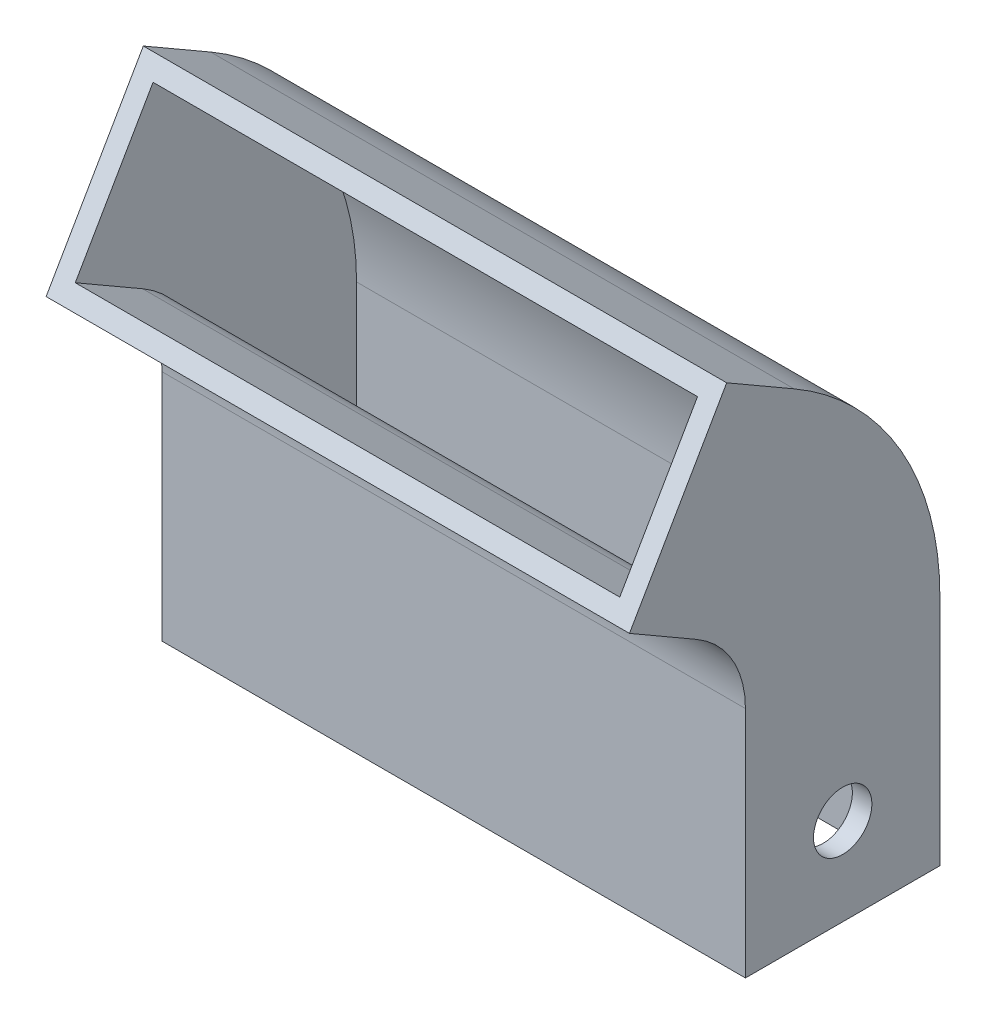
ISO-10303-21;
HEADER;
FILE_DESCRIPTION(('STEP AP214'),'2;1');
FILE_NAME('part.step','',(''),(''),'','','');
FILE_SCHEMA(('AUTOMOTIVE_DESIGN { 1 0 10303 214 1 1 1 1 }'));
ENDSEC;
DATA;
#1=APPLICATION_CONTEXT('core data for automotive mechanical design processes');
#2=APPLICATION_PROTOCOL_DEFINITION('international standard','automotive_design',2000,#1);
#3=PRODUCT_CONTEXT('',#1,'mechanical');
#4=PRODUCT('Part','Part','',(#3));
#5=PRODUCT_RELATED_PRODUCT_CATEGORY('part','',(#4));
#6=PRODUCT_DEFINITION_FORMATION('','',#4);
#7=PRODUCT_DEFINITION_CONTEXT('part definition',#1,'design');
#8=PRODUCT_DEFINITION('design','',#6,#7);
#9=PRODUCT_DEFINITION_SHAPE('','',#8);
#10=(LENGTH_UNIT() NAMED_UNIT(*) SI_UNIT(.MILLI.,.METRE.));
#11=(NAMED_UNIT(*) PLANE_ANGLE_UNIT() SI_UNIT($,.RADIAN.));
#12=(NAMED_UNIT(*) SI_UNIT($,.STERADIAN.) SOLID_ANGLE_UNIT());
#13=UNCERTAINTY_MEASURE_WITH_UNIT(LENGTH_MEASURE(1.E-05),#10,'distance_accuracy_value','');
#14=(GEOMETRIC_REPRESENTATION_CONTEXT(3) GLOBAL_UNCERTAINTY_ASSIGNED_CONTEXT((#13)) GLOBAL_UNIT_ASSIGNED_CONTEXT((#10,
#11,#12)) REPRESENTATION_CONTEXT('',''));
#15=CARTESIAN_POINT('',(0.,0.,0.));
#16=DIRECTION('',(0.,0.,1.));
#17=DIRECTION('',(1.,0.,0.));
#18=AXIS2_PLACEMENT_3D('',#15,#16,#17);
#19=CARTESIAN_POINT('',(0.,0.,0.));
#20=DIRECTION('',(0.,-1.,0.));
#21=DIRECTION('',(0.,0.,-1.));
#22=AXIS2_PLACEMENT_3D('',#19,#20,#21);
#23=PLANE('',#22);
#24=DIRECTION('',(0.,0.,-1.));
#25=VECTOR('',#24,1.);
#26=CARTESIAN_POINT('',(15.,0.,5.));
#27=LINE('',#26,#25);
#28=CARTESIAN_POINT('',(15.,0.,5.));
#29=VERTEX_POINT('',#28);
#30=CARTESIAN_POINT('',(15.,0.,-5.));
#31=VERTEX_POINT('',#30);
#32=EDGE_CURVE('E272',#29,#31,#27,.T.);
#33=ORIENTED_EDGE('',*,*,#32,.F.);
#34=DIRECTION('',(1.,0.,0.));
#35=VECTOR('',#34,1.);
#36=CARTESIAN_POINT('',(-15.,0.,5.));
#37=LINE('',#36,#35);
#38=CARTESIAN_POINT('',(-15.,0.,5.));
#39=VERTEX_POINT('',#38);
#40=EDGE_CURVE('E80',#39,#29,#37,.T.);
#41=ORIENTED_EDGE('',*,*,#40,.F.);
#42=DIRECTION('',(0.,0.,1.));
#43=VECTOR('',#42,1.);
#44=CARTESIAN_POINT('',(-15.,0.,5.));
#45=LINE('',#44,#43);
#46=CARTESIAN_POINT('',(-15.,0.,-5.));
#47=VERTEX_POINT('',#46);
#48=EDGE_CURVE('E282',#47,#39,#45,.T.);
#49=ORIENTED_EDGE('',*,*,#48,.F.);
#50=DIRECTION('',(-1.,0.,0.));
#51=VECTOR('',#50,1.);
#52=CARTESIAN_POINT('',(-15.,0.,-5.));
#53=LINE('',#52,#51);
#54=EDGE_CURVE('E280',#31,#47,#53,.T.);
#55=ORIENTED_EDGE('',*,*,#54,.F.);
#56=EDGE_LOOP('',(#33,#41,#49,#55));
#57=FACE_BOUND('',#56,.T.);
#58=DIRECTION('',(1.,0.,0.));
#59=VECTOR('',#58,1.);
#60=CARTESIAN_POINT('',(-14.,0.,4.));
#61=LINE('',#60,#59);
#62=CARTESIAN_POINT('',(-14.,0.,4.));
#63=VERTEX_POINT('',#62);
#64=CARTESIAN_POINT('',(14.,0.,4.));
#65=VERTEX_POINT('',#64);
#66=EDGE_CURVE('E252',#63,#65,#61,.T.);
#67=ORIENTED_EDGE('',*,*,#66,.T.);
#68=DIRECTION('',(0.,0.,-1.));
#69=VECTOR('',#68,1.);
#70=CARTESIAN_POINT('',(14.,0.,4.));
#71=LINE('',#70,#69);
#72=CARTESIAN_POINT('',(14.,0.,-4.));
#73=VERTEX_POINT('',#72);
#74=EDGE_CURVE('E51',#65,#73,#71,.T.);
#75=ORIENTED_EDGE('',*,*,#74,.T.);
#76=DIRECTION('',(-1.,0.,0.));
#77=VECTOR('',#76,1.);
#78=CARTESIAN_POINT('',(-14.,0.,-4.));
#79=LINE('',#78,#77);
#80=CARTESIAN_POINT('',(-14.,0.,-4.));
#81=VERTEX_POINT('',#80);
#82=EDGE_CURVE('E257',#73,#81,#79,.T.);
#83=ORIENTED_EDGE('',*,*,#82,.T.);
#84=DIRECTION('',(0.,0.,1.));
#85=VECTOR('',#84,1.);
#86=CARTESIAN_POINT('',(-14.,0.,4.));
#87=LINE('',#86,#85);
#88=EDGE_CURVE('E260',#81,#63,#87,.T.);
#89=ORIENTED_EDGE('',*,*,#88,.T.);
#90=EDGE_LOOP('',(#67,#75,#83,#89));
#91=FACE_BOUND('',#90,.T.);
#92=ADVANCED_FACE('F35',(#57,#91),#23,.T.);
#93=CARTESIAN_POINT('',(15.,12.,5.));
#94=DIRECTION('',(-1.,0.,0.));
#95=DIRECTION('',(0.,0.,1.));
#96=AXIS2_PLACEMENT_3D('',#93,#94,#95);
#97=PLANE('',#96);
#98=CARTESIAN_POINT('',(15.,4.5,0.));
#99=DIRECTION('',(-1.,0.,0.));
#100=DIRECTION('',(0.,0.,1.));
#101=AXIS2_PLACEMENT_3D('',#98,#99,#100);
#102=CIRCLE('',#101,1.5);
#103=CARTESIAN_POINT('',(15.,4.5,1.5));
#104=VERTEX_POINT('',#103);
#105=EDGE_CURVE('E521',#104,#104,#102,.T.);
#106=ORIENTED_EDGE('',*,*,#105,.T.);
#107=EDGE_LOOP('',(#106));
#108=FACE_BOUND('',#107,.T.);
#109=ORIENTED_EDGE('',*,*,#32,.T.);
#110=DIRECTION('',(0.,-1.,0.));
#111=VECTOR('',#110,1.);
#112=CARTESIAN_POINT('',(15.,12.,-5.));
#113=LINE('',#112,#111);
#114=CARTESIAN_POINT('',(15.,12.,-5.));
#115=VERTEX_POINT('',#114);
#116=EDGE_CURVE('E11',#115,#31,#113,.T.);
#117=ORIENTED_EDGE('',*,*,#116,.F.);
#118=CARTESIAN_POINT('',(15.,12.,10.));
#119=DIRECTION('',(1.,0.,0.));
#120=DIRECTION('',(0.,0.,-1.));
#121=AXIS2_PLACEMENT_3D('',#118,#119,#120);
#122=CIRCLE('',#121,15.);
#123=CARTESIAN_POINT('',(15.,24.9903810567666,2.50000000000009));
#124=VERTEX_POINT('',#123);
#125=EDGE_CURVE('E243',#115,#124,#122,.T.);
#126=ORIENTED_EDGE('',*,*,#125,.T.);
#127=DIRECTION('',(0.,-0.499999999999995,-0.866025403784442));
#128=VECTOR('',#127,1.);
#129=CARTESIAN_POINT('',(15.,26.9903810567666,5.96410161513784));
#130=LINE('',#129,#128);
#131=CARTESIAN_POINT('',(15.,26.9903810567666,5.96410161513784));
#132=VERTEX_POINT('',#131);
#133=EDGE_CURVE('E211',#132,#124,#130,.T.);
#134=ORIENTED_EDGE('',*,*,#133,.F.);
#135=DIRECTION('',(0.,0.866025403784442,-0.499999999999995));
#136=VECTOR('',#135,1.);
#137=CARTESIAN_POINT('',(15.,26.9903810567666,5.96410161513784));
#138=LINE('',#137,#136);
#139=CARTESIAN_POINT('',(15.,18.3301270189222,10.9641016151378));
#140=VERTEX_POINT('',#139);
#141=EDGE_CURVE('E204',#140,#132,#138,.T.);
#142=ORIENTED_EDGE('',*,*,#141,.F.);
#143=DIRECTION('',(0.,-0.499999999999995,-0.866025403784442));
#144=VECTOR('',#143,1.);
#145=CARTESIAN_POINT('',(15.,18.3301270189222,10.9641016151378));
#146=LINE('',#145,#144);
#147=CARTESIAN_POINT('',(15.,16.3301270189222,7.50000000000003));
#148=VERTEX_POINT('',#147);
#149=EDGE_CURVE('E214',#140,#148,#146,.T.);
#150=ORIENTED_EDGE('',*,*,#149,.T.);
#151=CARTESIAN_POINT('',(15.,12.,10.));
#152=DIRECTION('',(1.,0.,0.));
#153=DIRECTION('',(0.,0.,-1.));
#154=AXIS2_PLACEMENT_3D('',#151,#152,#153);
#155=CIRCLE('',#154,5.);
#156=CARTESIAN_POINT('',(15.,12.,5.));
#157=VERTEX_POINT('',#156);
#158=EDGE_CURVE('E241',#157,#148,#155,.T.);
#159=ORIENTED_EDGE('',*,*,#158,.F.);
#160=DIRECTION('',(0.,-1.,0.));
#161=VECTOR('',#160,1.);
#162=CARTESIAN_POINT('',(15.,12.,5.));
#163=LINE('',#162,#161);
#164=EDGE_CURVE('E277',#157,#29,#163,.T.);
#165=ORIENTED_EDGE('',*,*,#164,.T.);
#166=EDGE_LOOP('',(#109,#117,#126,#134,#142,#150,#159,#165));
#167=FACE_BOUND('',#166,.T.);
#168=ADVANCED_FACE('F37',(#108,#167),#97,.F.);
#169=CARTESIAN_POINT('',(-15.,12.,-5.));
#170=DIRECTION('',(0.,0.,1.));
#171=DIRECTION('',(1.,0.,0.));
#172=AXIS2_PLACEMENT_3D('',#169,#170,#171);
#173=PLANE('',#172);
#174=ORIENTED_EDGE('',*,*,#54,.T.);
#175=DIRECTION('',(0.,-1.,0.));
#176=VECTOR('',#175,1.);
#177=CARTESIAN_POINT('',(-15.,12.,-5.));
#178=LINE('',#177,#176);
#179=CARTESIAN_POINT('',(-15.,12.,-5.));
#180=VERTEX_POINT('',#179);
#181=EDGE_CURVE('E44',#180,#47,#178,.T.);
#182=ORIENTED_EDGE('',*,*,#181,.F.);
#183=DIRECTION('',(-1.,0.,0.));
#184=VECTOR('',#183,1.);
#185=CARTESIAN_POINT('',(-15.,12.,-5.));
#186=LINE('',#185,#184);
#187=EDGE_CURVE('E85',#115,#180,#186,.T.);
#188=ORIENTED_EDGE('',*,*,#187,.F.);
#189=ORIENTED_EDGE('',*,*,#116,.T.);
#190=EDGE_LOOP('',(#174,#182,#188,#189));
#191=FACE_BOUND('',#190,.T.);
#192=ADVANCED_FACE('F333',(#191),#173,.F.);
#193=CARTESIAN_POINT('',(-15.,12.,5.));
#194=DIRECTION('',(1.,0.,0.));
#195=DIRECTION('',(0.,0.,-1.));
#196=AXIS2_PLACEMENT_3D('',#193,#194,#195);
#197=PLANE('',#196);
#198=CARTESIAN_POINT('',(-15.,4.5,0.));
#199=DIRECTION('',(-1.,0.,0.));
#200=DIRECTION('',(0.,0.,1.));
#201=AXIS2_PLACEMENT_3D('',#198,#199,#200);
#202=CIRCLE('',#201,1.5);
#203=CARTESIAN_POINT('',(-15.,4.5,1.5));
#204=VERTEX_POINT('',#203);
#205=EDGE_CURVE('E522',#204,#204,#202,.T.);
#206=ORIENTED_EDGE('',*,*,#205,.F.);
#207=EDGE_LOOP('',(#206));
#208=FACE_BOUND('',#207,.T.);
#209=ORIENTED_EDGE('',*,*,#48,.T.);
#210=DIRECTION('',(0.,-1.,0.));
#211=VECTOR('',#210,1.);
#212=CARTESIAN_POINT('',(-15.,12.,5.));
#213=LINE('',#212,#211);
#214=CARTESIAN_POINT('',(-15.,12.,5.));
#215=VERTEX_POINT('',#214);
#216=EDGE_CURVE('E60',#215,#39,#213,.T.);
#217=ORIENTED_EDGE('',*,*,#216,.F.);
#218=CARTESIAN_POINT('',(-15.,12.,10.));
#219=DIRECTION('',(1.,0.,0.));
#220=DIRECTION('',(0.,0.,-1.));
#221=AXIS2_PLACEMENT_3D('',#218,#219,#220);
#222=CIRCLE('',#221,5.);
#223=CARTESIAN_POINT('',(-15.,16.3301270189222,7.50000000000003));
#224=VERTEX_POINT('',#223);
#225=EDGE_CURVE('E220',#215,#224,#222,.T.);
#226=ORIENTED_EDGE('',*,*,#225,.T.);
#227=DIRECTION('',(0.,-0.499999999999995,-0.866025403784442));
#228=VECTOR('',#227,1.);
#229=CARTESIAN_POINT('',(-15.,18.3301270189222,10.9641016151378));
#230=LINE('',#229,#228);
#231=CARTESIAN_POINT('',(-15.,18.3301270189222,10.9641016151378));
#232=VERTEX_POINT('',#231);
#233=EDGE_CURVE('E217',#232,#224,#230,.T.);
#234=ORIENTED_EDGE('',*,*,#233,.F.);
#235=DIRECTION('',(0.,-0.866025403784442,0.499999999999995));
#236=VECTOR('',#235,1.);
#237=CARTESIAN_POINT('',(-15.,26.9903810567666,5.96410161513784));
#238=LINE('',#237,#236);
#239=CARTESIAN_POINT('',(-15.,26.9903810567666,5.96410161513784));
#240=VERTEX_POINT('',#239);
#241=EDGE_CURVE('E182',#240,#232,#238,.T.);
#242=ORIENTED_EDGE('',*,*,#241,.F.);
#243=DIRECTION('',(0.,-0.499999999999995,-0.866025403784442));
#244=VECTOR('',#243,1.);
#245=CARTESIAN_POINT('',(-15.,26.9903810567666,5.96410161513784));
#246=LINE('',#245,#244);
#247=CARTESIAN_POINT('',(-15.,24.9903810567666,2.50000000000008));
#248=VERTEX_POINT('',#247);
#249=EDGE_CURVE('E208',#240,#248,#246,.T.);
#250=ORIENTED_EDGE('',*,*,#249,.T.);
#251=CARTESIAN_POINT('',(-15.,12.,10.));
#252=DIRECTION('',(1.,0.,0.));
#253=DIRECTION('',(0.,0.,-1.));
#254=AXIS2_PLACEMENT_3D('',#251,#252,#253);
#255=CIRCLE('',#254,15.);
#256=EDGE_CURVE('E240',#180,#248,#255,.T.);
#257=ORIENTED_EDGE('',*,*,#256,.F.);
#258=ORIENTED_EDGE('',*,*,#181,.T.);
#259=EDGE_LOOP('',(#209,#217,#226,#234,#242,#250,#257,#258));
#260=FACE_BOUND('',#259,.T.);
#261=ADVANCED_FACE('F290',(#208,#260),#197,.F.);
#262=CARTESIAN_POINT('',(-15.,12.,5.));
#263=DIRECTION('',(0.,0.,-1.));
#264=DIRECTION('',(-1.,0.,0.));
#265=AXIS2_PLACEMENT_3D('',#262,#263,#264);
#266=PLANE('',#265);
#267=ORIENTED_EDGE('',*,*,#40,.T.);
#268=ORIENTED_EDGE('',*,*,#164,.F.);
#269=DIRECTION('',(1.,0.,0.));
#270=VECTOR('',#269,1.);
#271=CARTESIAN_POINT('',(-15.,12.,5.));
#272=LINE('',#271,#270);
#273=EDGE_CURVE('E274',#215,#157,#272,.T.);
#274=ORIENTED_EDGE('',*,*,#273,.F.);
#275=ORIENTED_EDGE('',*,*,#216,.T.);
#276=EDGE_LOOP('',(#267,#268,#274,#275));
#277=FACE_BOUND('',#276,.T.);
#278=ADVANCED_FACE('F297',(#277),#266,.F.);
#279=CARTESIAN_POINT('',(14.,12.,4.));
#280=DIRECTION('',(-1.,0.,0.));
#281=DIRECTION('',(0.,0.,1.));
#282=AXIS2_PLACEMENT_3D('',#279,#280,#281);
#283=PLANE('',#282);
#284=CARTESIAN_POINT('',(14.,4.5,0.));
#285=DIRECTION('',(-1.,0.,0.));
#286=DIRECTION('',(0.,0.,1.));
#287=AXIS2_PLACEMENT_3D('',#284,#285,#286);
#288=CIRCLE('',#287,1.5);
#289=CARTESIAN_POINT('',(14.,4.5,1.5));
#290=VERTEX_POINT('',#289);
#291=EDGE_CURVE('E174',#290,#290,#288,.T.);
#292=ORIENTED_EDGE('',*,*,#291,.F.);
#293=EDGE_LOOP('',(#292));
#294=FACE_BOUND('',#293,.T.);
#295=ORIENTED_EDGE('',*,*,#74,.F.);
#296=DIRECTION('',(0.,-1.,0.));
#297=VECTOR('',#296,1.);
#298=CARTESIAN_POINT('',(14.,12.,4.));
#299=LINE('',#298,#297);
#300=CARTESIAN_POINT('',(14.,12.,4.));
#301=VERTEX_POINT('',#300);
#302=EDGE_CURVE('E255',#301,#65,#299,.T.);
#303=ORIENTED_EDGE('',*,*,#302,.F.);
#304=CARTESIAN_POINT('',(14.,12.,10.));
#305=DIRECTION('',(1.,0.,0.));
#306=DIRECTION('',(0.,0.,-1.));
#307=AXIS2_PLACEMENT_3D('',#304,#305,#306);
#308=CIRCLE('',#307,6.);
#309=CARTESIAN_POINT('',(14.,17.1961524227067,7.00000000000004));
#310=VERTEX_POINT('',#309);
#311=EDGE_CURVE('E221',#301,#310,#308,.T.);
#312=ORIENTED_EDGE('',*,*,#311,.T.);
#313=DIRECTION('',(0.,-0.499999999999995,-0.866025403784442));
#314=VECTOR('',#313,1.);
#315=CARTESIAN_POINT('',(14.,19.1961524227066,10.4641016151378));
#316=LINE('',#315,#314);
#317=CARTESIAN_POINT('',(14.,19.1961524227066,10.4641016151378));
#318=VERTEX_POINT('',#317);
#319=EDGE_CURVE('E183',#318,#310,#316,.T.);
#320=ORIENTED_EDGE('',*,*,#319,.F.);
#321=DIRECTION('',(0.,0.866025403784442,-0.499999999999995));
#322=VECTOR('',#321,1.);
#323=CARTESIAN_POINT('',(14.,26.1243556529822,6.46410161513784));
#324=LINE('',#323,#322);
#325=CARTESIAN_POINT('',(14.,26.1243556529822,6.46410161513784));
#326=VERTEX_POINT('',#325);
#327=EDGE_CURVE('E188',#318,#326,#324,.T.);
#328=ORIENTED_EDGE('',*,*,#327,.T.);
#329=DIRECTION('',(0.,-0.499999999999995,-0.866025403784442));
#330=VECTOR('',#329,1.);
#331=CARTESIAN_POINT('',(14.,26.1243556529822,6.46410161513784));
#332=LINE('',#331,#330);
#333=CARTESIAN_POINT('',(14.,24.1243556529822,3.00000000000007));
#334=VERTEX_POINT('',#333);
#335=EDGE_CURVE('E196',#326,#334,#332,.T.);
#336=ORIENTED_EDGE('',*,*,#335,.T.);
#337=CARTESIAN_POINT('',(14.,12.,10.));
#338=DIRECTION('',(1.,0.,0.));
#339=DIRECTION('',(0.,0.,-1.));
#340=AXIS2_PLACEMENT_3D('',#337,#338,#339);
#341=CIRCLE('',#340,14.);
#342=CARTESIAN_POINT('',(14.,12.,-4.));
#343=VERTEX_POINT('',#342);
#344=EDGE_CURVE('E224',#343,#334,#341,.T.);
#345=ORIENTED_EDGE('',*,*,#344,.F.);
#346=DIRECTION('',(0.,-1.,0.));
#347=VECTOR('',#346,1.);
#348=CARTESIAN_POINT('',(14.,12.,-4.));
#349=LINE('',#348,#347);
#350=EDGE_CURVE('E270',#343,#73,#349,.T.);
#351=ORIENTED_EDGE('',*,*,#350,.T.);
#352=EDGE_LOOP('',(#295,#303,#312,#320,#328,#336,#345,#351));
#353=FACE_BOUND('',#352,.T.);
#354=ADVANCED_FACE('F337',(#294,#353),#283,.T.);
#355=CARTESIAN_POINT('',(-14.,12.,-4.));
#356=DIRECTION('',(0.,0.,1.));
#357=DIRECTION('',(1.,0.,0.));
#358=AXIS2_PLACEMENT_3D('',#355,#356,#357);
#359=PLANE('',#358);
#360=ORIENTED_EDGE('',*,*,#82,.F.);
#361=ORIENTED_EDGE('',*,*,#350,.F.);
#362=DIRECTION('',(-1.,0.,0.));
#363=VECTOR('',#362,1.);
#364=CARTESIAN_POINT('',(-14.,12.,-4.));
#365=LINE('',#364,#363);
#366=CARTESIAN_POINT('',(-14.,12.,-4.));
#367=VERTEX_POINT('',#366);
#368=EDGE_CURVE('E248',#343,#367,#365,.T.);
#369=ORIENTED_EDGE('',*,*,#368,.T.);
#370=DIRECTION('',(0.,-1.,0.));
#371=VECTOR('',#370,1.);
#372=CARTESIAN_POINT('',(-14.,12.,-4.));
#373=LINE('',#372,#371);
#374=EDGE_CURVE('E268',#367,#81,#373,.T.);
#375=ORIENTED_EDGE('',*,*,#374,.T.);
#376=EDGE_LOOP('',(#360,#361,#369,#375));
#377=FACE_BOUND('',#376,.T.);
#378=ADVANCED_FACE('F363',(#377),#359,.T.);
#379=CARTESIAN_POINT('',(-14.,12.,4.));
#380=DIRECTION('',(1.,0.,0.));
#381=DIRECTION('',(0.,0.,-1.));
#382=AXIS2_PLACEMENT_3D('',#379,#380,#381);
#383=PLANE('',#382);
#384=CARTESIAN_POINT('',(-14.,4.5,0.));
#385=DIRECTION('',(1.,0.,0.));
#386=DIRECTION('',(0.,0.,-1.));
#387=AXIS2_PLACEMENT_3D('',#384,#385,#386);
#388=CIRCLE('',#387,1.5);
#389=CARTESIAN_POINT('',(-14.,4.5,-1.5));
#390=VERTEX_POINT('',#389);
#391=EDGE_CURVE('E39',#390,#390,#388,.T.);
#392=ORIENTED_EDGE('',*,*,#391,.F.);
#393=EDGE_LOOP('',(#392));
#394=FACE_BOUND('',#393,.T.);
#395=ORIENTED_EDGE('',*,*,#88,.F.);
#396=ORIENTED_EDGE('',*,*,#374,.F.);
#397=CARTESIAN_POINT('',(-14.,12.,10.));
#398=DIRECTION('',(1.,0.,0.));
#399=DIRECTION('',(0.,0.,-1.));
#400=AXIS2_PLACEMENT_3D('',#397,#398,#399);
#401=CIRCLE('',#400,14.);
#402=CARTESIAN_POINT('',(-14.,24.1243556529822,3.00000000000008));
#403=VERTEX_POINT('',#402);
#404=EDGE_CURVE('E230',#367,#403,#401,.T.);
#405=ORIENTED_EDGE('',*,*,#404,.T.);
#406=DIRECTION('',(0.,-0.499999999999995,-0.866025403784442));
#407=VECTOR('',#406,1.);
#408=CARTESIAN_POINT('',(-14.,26.1243556529822,6.46410161513784));
#409=LINE('',#408,#407);
#410=CARTESIAN_POINT('',(-14.,26.1243556529822,6.46410161513784));
#411=VERTEX_POINT('',#410);
#412=EDGE_CURVE('E169',#411,#403,#409,.T.);
#413=ORIENTED_EDGE('',*,*,#412,.F.);
#414=DIRECTION('',(0.,-0.866025403784442,0.499999999999995));
#415=VECTOR('',#414,1.);
#416=CARTESIAN_POINT('',(-14.,26.1243556529822,6.46410161513784));
#417=LINE('',#416,#415);
#418=CARTESIAN_POINT('',(-14.,19.1961524227066,10.4641016151378));
#419=VERTEX_POINT('',#418);
#420=EDGE_CURVE('E161',#411,#419,#417,.T.);
#421=ORIENTED_EDGE('',*,*,#420,.T.);
#422=DIRECTION('',(0.,-0.499999999999995,-0.866025403784442));
#423=VECTOR('',#422,1.);
#424=CARTESIAN_POINT('',(-14.,19.1961524227066,10.4641016151378));
#425=LINE('',#424,#423);
#426=CARTESIAN_POINT('',(-14.,17.1961524227067,7.00000000000004));
#427=VERTEX_POINT('',#426);
#428=EDGE_CURVE('E166',#419,#427,#425,.T.);
#429=ORIENTED_EDGE('',*,*,#428,.T.);
#430=CARTESIAN_POINT('',(-14.,12.,10.));
#431=DIRECTION('',(1.,0.,0.));
#432=DIRECTION('',(0.,0.,-1.));
#433=AXIS2_PLACEMENT_3D('',#430,#431,#432);
#434=CIRCLE('',#433,6.);
#435=CARTESIAN_POINT('',(-14.,12.,4.));
#436=VERTEX_POINT('',#435);
#437=EDGE_CURVE('E228',#436,#427,#434,.T.);
#438=ORIENTED_EDGE('',*,*,#437,.F.);
#439=DIRECTION('',(0.,-1.,0.));
#440=VECTOR('',#439,1.);
#441=CARTESIAN_POINT('',(-14.,12.,4.));
#442=LINE('',#441,#440);
#443=EDGE_CURVE('E266',#436,#63,#442,.T.);
#444=ORIENTED_EDGE('',*,*,#443,.T.);
#445=EDGE_LOOP('',(#395,#396,#405,#413,#421,#429,#438,#444));
#446=FACE_BOUND('',#445,.T.);
#447=ADVANCED_FACE('F164',(#394,#446),#383,.T.);
#448=CARTESIAN_POINT('',(-14.,12.,4.));
#449=DIRECTION('',(0.,0.,-1.));
#450=DIRECTION('',(-1.,0.,0.));
#451=AXIS2_PLACEMENT_3D('',#448,#449,#450);
#452=PLANE('',#451);
#453=ORIENTED_EDGE('',*,*,#66,.F.);
#454=ORIENTED_EDGE('',*,*,#443,.F.);
#455=DIRECTION('',(1.,0.,0.));
#456=VECTOR('',#455,1.);
#457=CARTESIAN_POINT('',(-14.,12.,4.));
#458=LINE('',#457,#456);
#459=EDGE_CURVE('E251',#436,#301,#458,.T.);
#460=ORIENTED_EDGE('',*,*,#459,.T.);
#461=ORIENTED_EDGE('',*,*,#302,.T.);
#462=EDGE_LOOP('',(#453,#454,#460,#461));
#463=FACE_BOUND('',#462,.T.);
#464=ADVANCED_FACE('F325',(#463),#452,.T.);
#465=CARTESIAN_POINT('',(15.,12.,10.));
#466=DIRECTION('',(1.,0.,0.));
#467=DIRECTION('',(0.,0.,-1.));
#468=AXIS2_PLACEMENT_3D('',#465,#466,#467);
#469=CYLINDRICAL_SURFACE('',#468,5.);
#470=ORIENTED_EDGE('',*,*,#158,.T.);
#471=DIRECTION('',(1.,0.,0.));
#472=VECTOR('',#471,1.);
#473=CARTESIAN_POINT('',(-15.,16.3301270189222,7.50000000000003));
#474=LINE('',#473,#472);
#475=EDGE_CURVE('E237',#224,#148,#474,.T.);
#476=ORIENTED_EDGE('',*,*,#475,.F.);
#477=ORIENTED_EDGE('',*,*,#225,.F.);
#478=ORIENTED_EDGE('',*,*,#273,.T.);
#479=EDGE_LOOP('',(#470,#476,#477,#478));
#480=FACE_BOUND('',#479,.T.);
#481=ADVANCED_FACE('F300',(#480),#469,.F.);
#482=CARTESIAN_POINT('',(15.,12.,10.));
#483=DIRECTION('',(1.,0.,0.));
#484=DIRECTION('',(0.,0.,-1.));
#485=AXIS2_PLACEMENT_3D('',#482,#483,#484);
#486=CYLINDRICAL_SURFACE('',#485,15.);
#487=ORIENTED_EDGE('',*,*,#256,.T.);
#488=DIRECTION('',(-1.,0.,0.));
#489=VECTOR('',#488,1.);
#490=CARTESIAN_POINT('',(15.,24.9903810567666,2.50000000000009));
#491=LINE('',#490,#489);
#492=EDGE_CURVE('E226',#124,#248,#491,.T.);
#493=ORIENTED_EDGE('',*,*,#492,.F.);
#494=ORIENTED_EDGE('',*,*,#125,.F.);
#495=ORIENTED_EDGE('',*,*,#187,.T.);
#496=EDGE_LOOP('',(#487,#493,#494,#495));
#497=FACE_BOUND('',#496,.T.);
#498=ADVANCED_FACE('F314',(#497),#486,.T.);
#499=CARTESIAN_POINT('',(15.,12.,10.));
#500=DIRECTION('',(1.,0.,0.));
#501=DIRECTION('',(0.,0.,-1.));
#502=AXIS2_PLACEMENT_3D('',#499,#500,#501);
#503=CYLINDRICAL_SURFACE('',#502,6.);
#504=ORIENTED_EDGE('',*,*,#437,.T.);
#505=DIRECTION('',(1.,0.,0.));
#506=VECTOR('',#505,1.);
#507=CARTESIAN_POINT('',(-14.,17.1961524227067,7.00000000000004));
#508=LINE('',#507,#506);
#509=EDGE_CURVE('E181',#310,#427,#508,.F.);
#510=ORIENTED_EDGE('',*,*,#509,.F.);
#511=ORIENTED_EDGE('',*,*,#311,.F.);
#512=ORIENTED_EDGE('',*,*,#459,.F.);
#513=EDGE_LOOP('',(#504,#510,#511,#512));
#514=FACE_BOUND('',#513,.T.);
#515=ADVANCED_FACE('F316',(#514),#503,.T.);
#516=CARTESIAN_POINT('',(15.,12.,10.));
#517=DIRECTION('',(1.,0.,0.));
#518=DIRECTION('',(0.,0.,-1.));
#519=AXIS2_PLACEMENT_3D('',#516,#517,#518);
#520=CYLINDRICAL_SURFACE('',#519,14.);
#521=DIRECTION('',(-1.,0.,0.));
#522=VECTOR('',#521,1.);
#523=CARTESIAN_POINT('',(14.,24.1243556529822,3.00000000000008));
#524=LINE('',#523,#522);
#525=EDGE_CURVE('E232',#403,#334,#524,.F.);
#526=ORIENTED_EDGE('',*,*,#525,.F.);
#527=ORIENTED_EDGE('',*,*,#404,.F.);
#528=ORIENTED_EDGE('',*,*,#368,.F.);
#529=ORIENTED_EDGE('',*,*,#344,.T.);
#530=EDGE_LOOP('',(#526,#527,#528,#529));
#531=FACE_BOUND('',#530,.T.);
#532=ADVANCED_FACE('F322',(#531),#520,.F.);
#533=CARTESIAN_POINT('',(0.,9.33012701892208,16.1602540378444));
#534=DIRECTION('',(0.,0.499999999999995,0.866025403784442));
#535=DIRECTION('',(0.,-0.866025403784442,0.499999999999995));
#536=AXIS2_PLACEMENT_3D('',#533,#534,#535);
#537=PLANE('',#536);
#538=ORIENTED_EDGE('',*,*,#241,.T.);
#539=DIRECTION('',(1.,0.,0.));
#540=VECTOR('',#539,1.);
#541=CARTESIAN_POINT('',(-15.,18.3301270189222,10.9641016151378));
#542=LINE('',#541,#540);
#543=EDGE_CURVE('E202',#232,#140,#542,.T.);
#544=ORIENTED_EDGE('',*,*,#543,.T.);
#545=ORIENTED_EDGE('',*,*,#141,.T.);
#546=DIRECTION('',(-1.,0.,0.));
#547=VECTOR('',#546,1.);
#548=CARTESIAN_POINT('',(-15.,26.9903810567666,5.96410161513784));
#549=LINE('',#548,#547);
#550=EDGE_CURVE('E206',#132,#240,#549,.T.);
#551=ORIENTED_EDGE('',*,*,#550,.T.);
#552=EDGE_LOOP('',(#538,#544,#545,#551));
#553=FACE_BOUND('',#552,.T.);
#554=DIRECTION('',(1.,0.,0.));
#555=VECTOR('',#554,1.);
#556=CARTESIAN_POINT('',(-14.,19.1961524227066,10.4641016151378));
#557=LINE('',#556,#555);
#558=EDGE_CURVE('E173',#419,#318,#557,.T.);
#559=ORIENTED_EDGE('',*,*,#558,.F.);
#560=ORIENTED_EDGE('',*,*,#420,.F.);
#561=DIRECTION('',(-1.,0.,0.));
#562=VECTOR('',#561,1.);
#563=CARTESIAN_POINT('',(-14.,26.1243556529822,6.46410161513784));
#564=LINE('',#563,#562);
#565=EDGE_CURVE('E190',#326,#411,#564,.T.);
#566=ORIENTED_EDGE('',*,*,#565,.F.);
#567=ORIENTED_EDGE('',*,*,#327,.F.);
#568=EDGE_LOOP('',(#559,#560,#566,#567));
#569=FACE_BOUND('',#568,.T.);
#570=ADVANCED_FACE('F186',(#553,#569),#537,.T.);
#571=CARTESIAN_POINT('',(-15.,18.3301270189222,10.9641016151378));
#572=DIRECTION('',(0.,0.866025403784442,-0.499999999999995));
#573=DIRECTION('',(0.,0.499999999999995,0.866025403784442));
#574=AXIS2_PLACEMENT_3D('',#571,#572,#573);
#575=PLANE('',#574);
#576=ORIENTED_EDGE('',*,*,#475,.T.);
#577=ORIENTED_EDGE('',*,*,#149,.F.);
#578=ORIENTED_EDGE('',*,*,#543,.F.);
#579=ORIENTED_EDGE('',*,*,#233,.T.);
#580=EDGE_LOOP('',(#576,#577,#578,#579));
#581=FACE_BOUND('',#580,.T.);
#582=ADVANCED_FACE('F304',(#581),#575,.F.);
#583=CARTESIAN_POINT('',(-15.,26.9903810567666,5.96410161513784));
#584=DIRECTION('',(0.,-0.866025403784442,0.499999999999995));
#585=DIRECTION('',(0.,-0.499999999999995,-0.866025403784442));
#586=AXIS2_PLACEMENT_3D('',#583,#584,#585);
#587=PLANE('',#586);
#588=ORIENTED_EDGE('',*,*,#492,.T.);
#589=ORIENTED_EDGE('',*,*,#249,.F.);
#590=ORIENTED_EDGE('',*,*,#550,.F.);
#591=ORIENTED_EDGE('',*,*,#133,.T.);
#592=EDGE_LOOP('',(#588,#589,#590,#591));
#593=FACE_BOUND('',#592,.T.);
#594=ADVANCED_FACE('F311',(#593),#587,.F.);
#595=CARTESIAN_POINT('',(-14.,19.1961524227066,10.4641016151378));
#596=DIRECTION('',(0.,0.866025403784442,-0.499999999999995));
#597=DIRECTION('',(0.,0.499999999999995,0.866025403784442));
#598=AXIS2_PLACEMENT_3D('',#595,#596,#597);
#599=PLANE('',#598);
#600=ORIENTED_EDGE('',*,*,#509,.T.);
#601=ORIENTED_EDGE('',*,*,#428,.F.);
#602=ORIENTED_EDGE('',*,*,#558,.T.);
#603=ORIENTED_EDGE('',*,*,#319,.T.);
#604=EDGE_LOOP('',(#600,#601,#602,#603));
#605=FACE_BOUND('',#604,.T.);
#606=ADVANCED_FACE('F178',(#605),#599,.T.);
#607=CARTESIAN_POINT('',(-14.,26.1243556529822,6.46410161513784));
#608=DIRECTION('',(0.,-0.866025403784442,0.499999999999995));
#609=DIRECTION('',(0.,-0.499999999999995,-0.866025403784442));
#610=AXIS2_PLACEMENT_3D('',#607,#608,#609);
#611=PLANE('',#610);
#612=ORIENTED_EDGE('',*,*,#525,.T.);
#613=ORIENTED_EDGE('',*,*,#335,.F.);
#614=ORIENTED_EDGE('',*,*,#565,.T.);
#615=ORIENTED_EDGE('',*,*,#412,.T.);
#616=EDGE_LOOP('',(#612,#613,#614,#615));
#617=FACE_BOUND('',#616,.T.);
#618=ADVANCED_FACE('F441',(#617),#611,.T.);
#619=CARTESIAN_POINT('',(15.,4.5,0.));
#620=DIRECTION('',(-1.,0.,0.));
#621=DIRECTION('',(0.,0.,1.));
#622=AXIS2_PLACEMENT_3D('',#619,#620,#621);
#623=CYLINDRICAL_SURFACE('',#622,1.5);
#624=ORIENTED_EDGE('',*,*,#391,.T.);
#625=EDGE_LOOP('',(#624));
#626=FACE_BOUND('',#625,.T.);
#627=ORIENTED_EDGE('',*,*,#205,.T.);
#628=EDGE_LOOP('',(#627));
#629=FACE_BOUND('',#628,.T.);
#630=ADVANCED_FACE('F449',(#626,#629),#623,.F.);
#631=ORIENTED_EDGE('',*,*,#291,.T.);
#632=EDGE_LOOP('',(#631));
#633=FACE_BOUND('',#632,.T.);
#634=ORIENTED_EDGE('',*,*,#105,.F.);
#635=EDGE_LOOP('',(#634));
#636=FACE_BOUND('',#635,.T.);
#637=ADVANCED_FACE('F503',(#633,#636),#623,.F.);
#638=CLOSED_SHELL('',(#92,#168,#192,#261,#278,#354,#378,#447,#464,#481,#498,#515,#532,#570,#582,
#594,#606,#618,#630,#637));
#639=MANIFOLD_SOLID_BREP('B2',#638);
#640=ADVANCED_BREP_SHAPE_REPRESENTATION('',(#18,#639),#14);
#641=SHAPE_DEFINITION_REPRESENTATION(#9,#640);
ENDSEC;
END-ISO-10303-21;
